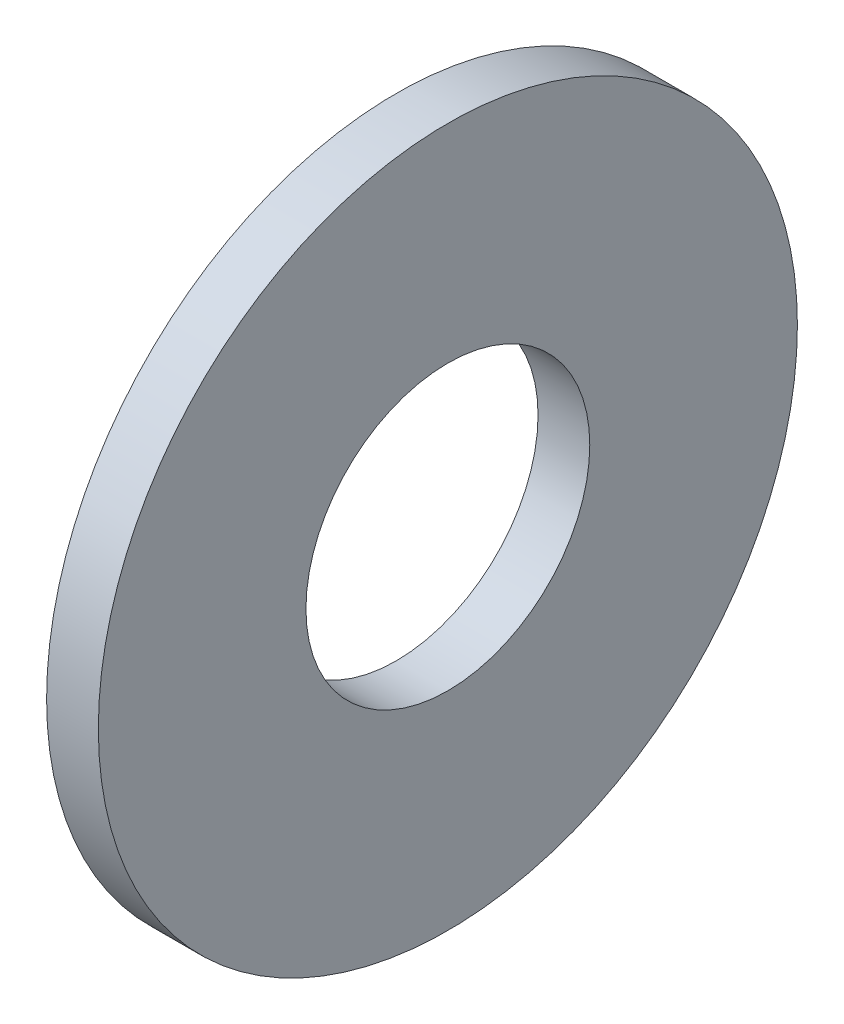
ISO-10303-21;
HEADER;
FILE_DESCRIPTION(('STEP AP214'),'2;1');
FILE_NAME('part.step','',(''),(''),'','','');
FILE_SCHEMA(('AUTOMOTIVE_DESIGN { 1 0 10303 214 1 1 1 1 }'));
ENDSEC;
DATA;
#1=APPLICATION_CONTEXT('core data for automotive mechanical design processes');
#2=APPLICATION_PROTOCOL_DEFINITION('international standard','automotive_design',2000,#1);
#3=PRODUCT_CONTEXT('',#1,'mechanical');
#4=PRODUCT('Part','Part','',(#3));
#5=PRODUCT_RELATED_PRODUCT_CATEGORY('part','',(#4));
#6=PRODUCT_DEFINITION_FORMATION('','',#4);
#7=PRODUCT_DEFINITION_CONTEXT('part definition',#1,'design');
#8=PRODUCT_DEFINITION('design','',#6,#7);
#9=PRODUCT_DEFINITION_SHAPE('','',#8);
#10=(LENGTH_UNIT() NAMED_UNIT(*) SI_UNIT(.MILLI.,.METRE.));
#11=(NAMED_UNIT(*) PLANE_ANGLE_UNIT() SI_UNIT($,.RADIAN.));
#12=(NAMED_UNIT(*) SI_UNIT($,.STERADIAN.) SOLID_ANGLE_UNIT());
#13=UNCERTAINTY_MEASURE_WITH_UNIT(LENGTH_MEASURE(1.E-05),#10,'distance_accuracy_value','');
#14=(GEOMETRIC_REPRESENTATION_CONTEXT(3) GLOBAL_UNCERTAINTY_ASSIGNED_CONTEXT((#13)) GLOBAL_UNIT_ASSIGNED_CONTEXT((#10,
#11,#12)) REPRESENTATION_CONTEXT('',''));
#15=CARTESIAN_POINT('',(0.,0.,0.));
#16=DIRECTION('',(0.,0.,1.));
#17=DIRECTION('',(1.,0.,0.));
#18=AXIS2_PLACEMENT_3D('',#15,#16,#17);
#19=CARTESIAN_POINT('',(1.8796,0.,0.));
#20=DIRECTION('',(1.,0.,0.));
#21=DIRECTION('',(0.,0.,-1.));
#22=AXIS2_PLACEMENT_3D('',#19,#20,#21);
#23=PLANE('',#22);
#24=CARTESIAN_POINT('',(1.8796,0.,0.));
#25=DIRECTION('',(1.,0.,0.));
#26=DIRECTION('',(0.,0.,-1.));
#27=AXIS2_PLACEMENT_3D('',#24,#25,#26);
#28=CIRCLE('',#27,12.7);
#29=CARTESIAN_POINT('',(1.8796,0.,-12.7));
#30=VERTEX_POINT('',#29);
#31=EDGE_CURVE('E10',#30,#30,#28,.T.);
#32=ORIENTED_EDGE('',*,*,#31,.T.);
#33=EDGE_LOOP('',(#32));
#34=FACE_BOUND('',#33,.T.);
#35=CARTESIAN_POINT('',(1.8796,0.,0.));
#36=DIRECTION('',(1.,0.,0.));
#37=DIRECTION('',(0.,0.,-1.));
#38=AXIS2_PLACEMENT_3D('',#35,#36,#37);
#39=CIRCLE('',#38,5.1562);
#40=CARTESIAN_POINT('',(1.8796,0.,-5.1562));
#41=VERTEX_POINT('',#40);
#42=EDGE_CURVE('E40',#41,#41,#39,.T.);
#43=ORIENTED_EDGE('',*,*,#42,.F.);
#44=EDGE_LOOP('',(#43));
#45=FACE_BOUND('',#44,.T.);
#46=ADVANCED_FACE('F29',(#34,#45),#23,.T.);
#47=CARTESIAN_POINT('',(0.,0.,0.));
#48=DIRECTION('',(1.,0.,0.));
#49=DIRECTION('',(0.,0.,-1.));
#50=AXIS2_PLACEMENT_3D('',#47,#48,#49);
#51=PLANE('',#50);
#52=CARTESIAN_POINT('',(0.,0.,0.));
#53=DIRECTION('',(1.,0.,0.));
#54=DIRECTION('',(0.,0.,-1.));
#55=AXIS2_PLACEMENT_3D('',#52,#53,#54);
#56=CIRCLE('',#55,12.7);
#57=CARTESIAN_POINT('',(0.,0.,-12.7));
#58=VERTEX_POINT('',#57);
#59=EDGE_CURVE('E33',#58,#58,#56,.T.);
#60=ORIENTED_EDGE('',*,*,#59,.F.);
#61=EDGE_LOOP('',(#60));
#62=FACE_BOUND('',#61,.T.);
#63=CARTESIAN_POINT('',(0.,0.,0.));
#64=DIRECTION('',(1.,0.,0.));
#65=DIRECTION('',(0.,0.,-1.));
#66=AXIS2_PLACEMENT_3D('',#63,#64,#65);
#67=CIRCLE('',#66,5.1562);
#68=CARTESIAN_POINT('',(0.,0.,-5.1562));
#69=VERTEX_POINT('',#68);
#70=EDGE_CURVE('E42',#69,#69,#67,.T.);
#71=ORIENTED_EDGE('',*,*,#70,.T.);
#72=EDGE_LOOP('',(#71));
#73=FACE_BOUND('',#72,.T.);
#74=ADVANCED_FACE('F52',(#62,#73),#51,.F.);
#75=CARTESIAN_POINT('',(1.8796,0.,0.));
#76=DIRECTION('',(-1.,0.,0.));
#77=DIRECTION('',(0.,0.,1.));
#78=AXIS2_PLACEMENT_3D('',#75,#76,#77);
#79=CYLINDRICAL_SURFACE('',#78,12.7);
#80=ORIENTED_EDGE('',*,*,#31,.F.);
#81=EDGE_LOOP('',(#80));
#82=FACE_BOUND('',#81,.T.);
#83=ORIENTED_EDGE('',*,*,#59,.T.);
#84=EDGE_LOOP('',(#83));
#85=FACE_BOUND('',#84,.T.);
#86=ADVANCED_FACE('F31',(#82,#85),#79,.T.);
#87=CARTESIAN_POINT('',(1.8796,0.,0.));
#88=DIRECTION('',(-1.,0.,0.));
#89=DIRECTION('',(0.,0.,1.));
#90=AXIS2_PLACEMENT_3D('',#87,#88,#89);
#91=CYLINDRICAL_SURFACE('',#90,5.1562);
#92=ORIENTED_EDGE('',*,*,#42,.T.);
#93=EDGE_LOOP('',(#92));
#94=FACE_BOUND('',#93,.T.);
#95=ORIENTED_EDGE('',*,*,#70,.F.);
#96=EDGE_LOOP('',(#95));
#97=FACE_BOUND('',#96,.T.);
#98=ADVANCED_FACE('F48',(#94,#97),#91,.F.);
#99=CLOSED_SHELL('',(#46,#74,#86,#98));
#100=MANIFOLD_SOLID_BREP('B2',#99);
#101=ADVANCED_BREP_SHAPE_REPRESENTATION('',(#18,#100),#14);
#102=SHAPE_DEFINITION_REPRESENTATION(#9,#101);
ENDSEC;
END-ISO-10303-21;
